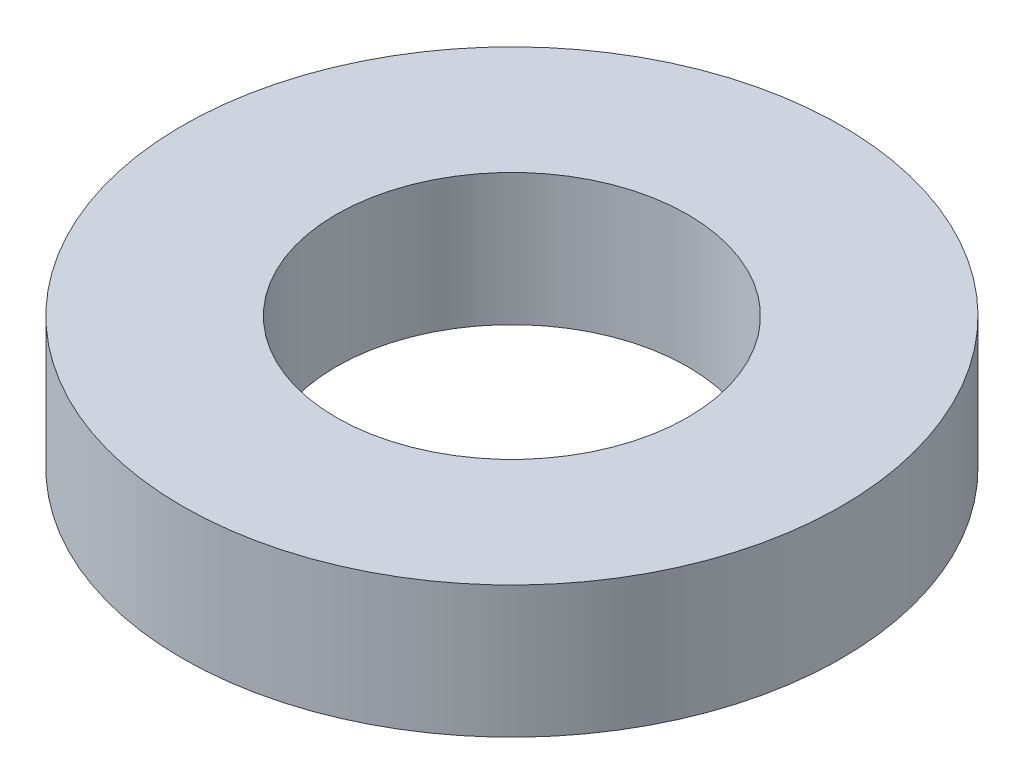
ISO-10303-21;
HEADER;
FILE_DESCRIPTION(('STEP AP214'),'2;1');
FILE_NAME('part.step','',(''),(''),'','','');
FILE_SCHEMA(('AUTOMOTIVE_DESIGN { 1 0 10303 214 1 1 1 1 }'));
ENDSEC;
DATA;
#1=APPLICATION_CONTEXT('core data for automotive mechanical design processes');
#2=APPLICATION_PROTOCOL_DEFINITION('international standard','automotive_design',2000,#1);
#3=PRODUCT_CONTEXT('',#1,'mechanical');
#4=PRODUCT('Part','Part','',(#3));
#5=PRODUCT_RELATED_PRODUCT_CATEGORY('part','',(#4));
#6=PRODUCT_DEFINITION_FORMATION('','',#4);
#7=PRODUCT_DEFINITION_CONTEXT('part definition',#1,'design');
#8=PRODUCT_DEFINITION('design','',#6,#7);
#9=PRODUCT_DEFINITION_SHAPE('','',#8);
#10=(LENGTH_UNIT() NAMED_UNIT(*) SI_UNIT(.MILLI.,.METRE.));
#11=(NAMED_UNIT(*) PLANE_ANGLE_UNIT() SI_UNIT($,.RADIAN.));
#12=(NAMED_UNIT(*) SI_UNIT($,.STERADIAN.) SOLID_ANGLE_UNIT());
#13=UNCERTAINTY_MEASURE_WITH_UNIT(LENGTH_MEASURE(1.E-05),#10,'distance_accuracy_value','');
#14=(GEOMETRIC_REPRESENTATION_CONTEXT(3) GLOBAL_UNCERTAINTY_ASSIGNED_CONTEXT((#13)) GLOBAL_UNIT_ASSIGNED_CONTEXT((#10,
#11,#12)) REPRESENTATION_CONTEXT('',''));
#15=CARTESIAN_POINT('',(0.,0.,0.));
#16=DIRECTION('',(0.,0.,1.));
#17=DIRECTION('',(1.,0.,0.));
#18=AXIS2_PLACEMENT_3D('',#15,#16,#17);
#19=CARTESIAN_POINT('',(0.,30.,0.));
#20=DIRECTION('',(0.,-1.,0.));
#21=DIRECTION('',(0.,0.,-1.));
#22=AXIS2_PLACEMENT_3D('',#19,#20,#21);
#23=CYLINDRICAL_SURFACE('',#22,75.);
#24=CARTESIAN_POINT('',(0.,30.,0.));
#25=DIRECTION('',(0.,1.,0.));
#26=DIRECTION('',(0.,0.,1.));
#27=AXIS2_PLACEMENT_3D('',#24,#25,#26);
#28=CIRCLE('',#27,75.);
#29=CARTESIAN_POINT('',(0.,30.,75.));
#30=VERTEX_POINT('',#29);
#31=EDGE_CURVE('E10',#30,#30,#28,.T.);
#32=ORIENTED_EDGE('',*,*,#31,.F.);
#33=EDGE_LOOP('',(#32));
#34=FACE_BOUND('',#33,.T.);
#35=CARTESIAN_POINT('',(0.,0.,0.));
#36=DIRECTION('',(0.,1.,0.));
#37=DIRECTION('',(0.,0.,1.));
#38=AXIS2_PLACEMENT_3D('',#35,#36,#37);
#39=CIRCLE('',#38,75.);
#40=CARTESIAN_POINT('',(0.,0.,75.));
#41=VERTEX_POINT('',#40);
#42=EDGE_CURVE('E37',#41,#41,#39,.T.);
#43=ORIENTED_EDGE('',*,*,#42,.T.);
#44=EDGE_LOOP('',(#43));
#45=FACE_BOUND('',#44,.T.);
#46=ADVANCED_FACE('F40',(#34,#45),#23,.T.);
#47=CARTESIAN_POINT('',(0.,30.,0.));
#48=DIRECTION('',(0.,1.,0.));
#49=DIRECTION('',(0.,0.,1.));
#50=AXIS2_PLACEMENT_3D('',#47,#48,#49);
#51=PLANE('',#50);
#52=CARTESIAN_POINT('',(0.,30.,0.));
#53=DIRECTION('',(0.,1.,0.));
#54=DIRECTION('',(0.,0.,1.));
#55=AXIS2_PLACEMENT_3D('',#52,#53,#54);
#56=CIRCLE('',#55,40.);
#57=CARTESIAN_POINT('',(0.,30.,40.));
#58=VERTEX_POINT('',#57);
#59=EDGE_CURVE('E50',#58,#58,#56,.T.);
#60=ORIENTED_EDGE('',*,*,#59,.F.);
#61=EDGE_LOOP('',(#60));
#62=FACE_BOUND('',#61,.T.);
#63=ORIENTED_EDGE('',*,*,#31,.T.);
#64=EDGE_LOOP('',(#63));
#65=FACE_BOUND('',#64,.T.);
#66=ADVANCED_FACE('F59',(#62,#65),#51,.T.);
#67=CARTESIAN_POINT('',(0.,0.,0.));
#68=DIRECTION('',(0.,1.,0.));
#69=DIRECTION('',(0.,0.,1.));
#70=AXIS2_PLACEMENT_3D('',#67,#68,#69);
#71=PLANE('',#70);
#72=CARTESIAN_POINT('',(0.,0.,0.));
#73=DIRECTION('',(0.,1.,0.));
#74=DIRECTION('',(0.,0.,1.));
#75=AXIS2_PLACEMENT_3D('',#72,#73,#74);
#76=CIRCLE('',#75,40.);
#77=CARTESIAN_POINT('',(0.,0.,40.));
#78=VERTEX_POINT('',#77);
#79=EDGE_CURVE('E47',#78,#78,#76,.T.);
#80=ORIENTED_EDGE('',*,*,#79,.T.);
#81=EDGE_LOOP('',(#80));
#82=FACE_BOUND('',#81,.T.);
#83=ORIENTED_EDGE('',*,*,#42,.F.);
#84=EDGE_LOOP('',(#83));
#85=FACE_BOUND('',#84,.T.);
#86=ADVANCED_FACE('F58',(#82,#85),#71,.F.);
#87=CARTESIAN_POINT('',(0.,30.,0.));
#88=DIRECTION('',(0.,-1.,0.));
#89=DIRECTION('',(0.,0.,-1.));
#90=AXIS2_PLACEMENT_3D('',#87,#88,#89);
#91=CYLINDRICAL_SURFACE('',#90,40.);
#92=ORIENTED_EDGE('',*,*,#59,.T.);
#93=EDGE_LOOP('',(#92));
#94=FACE_BOUND('',#93,.T.);
#95=ORIENTED_EDGE('',*,*,#79,.F.);
#96=EDGE_LOOP('',(#95));
#97=FACE_BOUND('',#96,.T.);
#98=ADVANCED_FACE('F54',(#94,#97),#91,.F.);
#99=CLOSED_SHELL('',(#46,#66,#86,#98));
#100=MANIFOLD_SOLID_BREP('B2',#99);
#101=ADVANCED_BREP_SHAPE_REPRESENTATION('',(#18,#100),#14);
#102=SHAPE_DEFINITION_REPRESENTATION(#9,#101);
ENDSEC;
END-ISO-10303-21;
